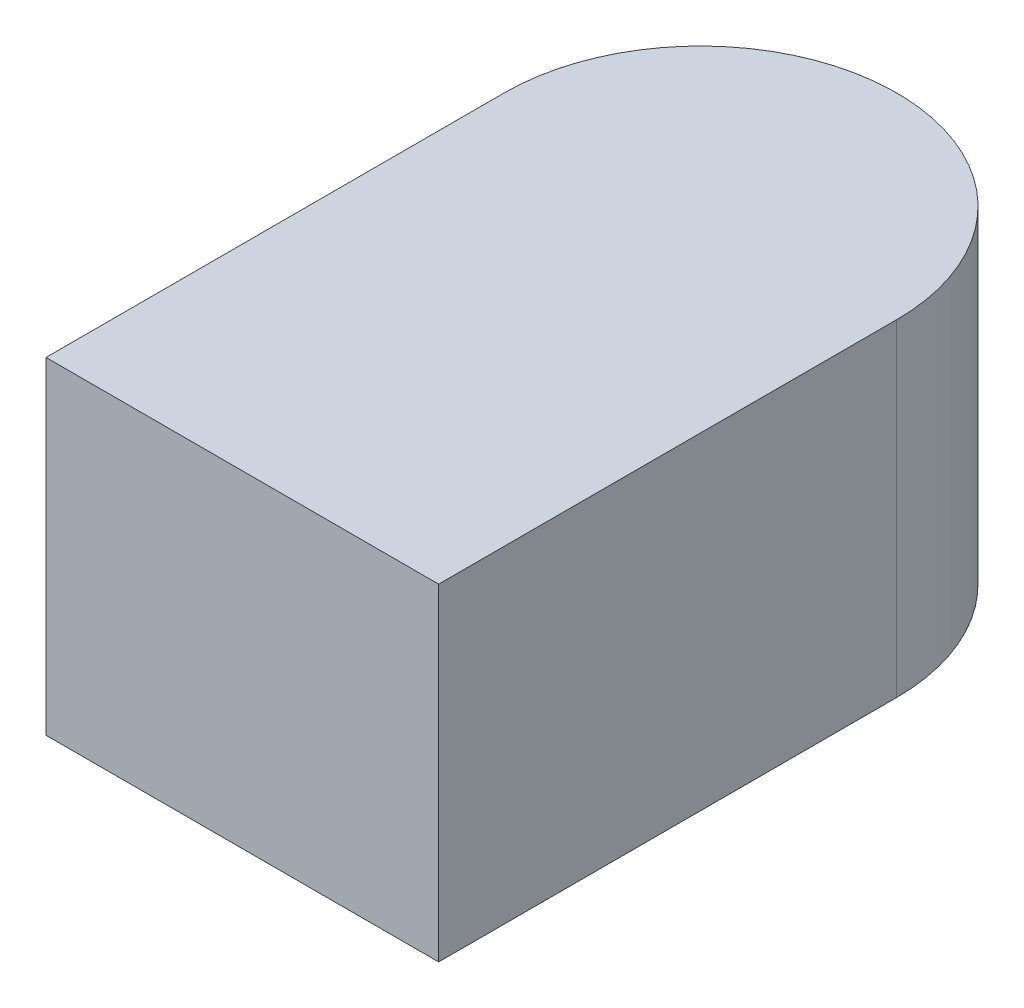
ISO-10303-21;
HEADER;
FILE_DESCRIPTION(('STEP AP214'),'2;1');
FILE_NAME('part.step','',(''),(''),'','','');
FILE_SCHEMA(('AUTOMOTIVE_DESIGN { 1 0 10303 214 1 1 1 1 }'));
ENDSEC;
DATA;
#1=APPLICATION_CONTEXT('core data for automotive mechanical design processes');
#2=APPLICATION_PROTOCOL_DEFINITION('international standard','automotive_design',2000,#1);
#3=PRODUCT_CONTEXT('',#1,'mechanical');
#4=PRODUCT('Part','Part','',(#3));
#5=PRODUCT_RELATED_PRODUCT_CATEGORY('part','',(#4));
#6=PRODUCT_DEFINITION_FORMATION('','',#4);
#7=PRODUCT_DEFINITION_CONTEXT('part definition',#1,'design');
#8=PRODUCT_DEFINITION('design','',#6,#7);
#9=PRODUCT_DEFINITION_SHAPE('','',#8);
#10=(LENGTH_UNIT() NAMED_UNIT(*) SI_UNIT(.MILLI.,.METRE.));
#11=(NAMED_UNIT(*) PLANE_ANGLE_UNIT() SI_UNIT($,.RADIAN.));
#12=(NAMED_UNIT(*) SI_UNIT($,.STERADIAN.) SOLID_ANGLE_UNIT());
#13=UNCERTAINTY_MEASURE_WITH_UNIT(LENGTH_MEASURE(1.E-05),#10,'distance_accuracy_value','');
#14=(GEOMETRIC_REPRESENTATION_CONTEXT(3) GLOBAL_UNCERTAINTY_ASSIGNED_CONTEXT((#13)) GLOBAL_UNIT_ASSIGNED_CONTEXT((#10,
#11,#12)) REPRESENTATION_CONTEXT('',''));
#15=CARTESIAN_POINT('',(0.,0.,0.));
#16=DIRECTION('',(0.,0.,1.));
#17=DIRECTION('',(1.,0.,0.));
#18=AXIS2_PLACEMENT_3D('',#15,#16,#17);
#19=CARTESIAN_POINT('',(0.,0.,0.));
#20=DIRECTION('',(0.,-1.,0.));
#21=DIRECTION('',(1.,0.,0.));
#22=AXIS2_PLACEMENT_3D('',#19,#20,#21);
#23=PLANE('',#22);
#24=CARTESIAN_POINT('',(0.75,0.,1.97));
#25=DIRECTION('',(0.,-1.,0.));
#26=DIRECTION('',(-1.,0.,0.));
#27=AXIS2_PLACEMENT_3D('',#24,#25,#26);
#28=CIRCLE('',#27,0.12);
#29=CARTESIAN_POINT('',(0.63,0.,1.97));
#30=VERTEX_POINT('',#29);
#31=CARTESIAN_POINT('',(0.87,0.,1.97));
#32=VERTEX_POINT('',#31);
#33=EDGE_CURVE('E11',#30,#32,#28,.T.);
#34=ORIENTED_EDGE('',*,*,#33,.T.);
#35=DIRECTION('',(0.,0.,1.));
#36=VECTOR('',#35,1.);
#37=CARTESIAN_POINT('',(0.87,0.,1.97));
#38=LINE('',#37,#36);
#39=CARTESIAN_POINT('',(0.87,0.,2.25));
#40=VERTEX_POINT('',#39);
#41=EDGE_CURVE('E24',#32,#40,#38,.T.);
#42=ORIENTED_EDGE('',*,*,#41,.T.);
#43=DIRECTION('',(-1.,0.,0.));
#44=VECTOR('',#43,1.);
#45=CARTESIAN_POINT('',(0.87,0.,2.25));
#46=LINE('',#45,#44);
#47=CARTESIAN_POINT('',(0.63,0.,2.25));
#48=VERTEX_POINT('',#47);
#49=EDGE_CURVE('E62',#40,#48,#46,.T.);
#50=ORIENTED_EDGE('',*,*,#49,.T.);
#51=DIRECTION('',(0.,0.,-1.));
#52=VECTOR('',#51,1.);
#53=CARTESIAN_POINT('',(0.63,0.,2.25));
#54=LINE('',#53,#52);
#55=EDGE_CURVE('E36',#48,#30,#54,.T.);
#56=ORIENTED_EDGE('',*,*,#55,.T.);
#57=EDGE_LOOP('',(#34,#42,#50,#56));
#58=FACE_BOUND('',#57,.T.);
#59=ADVANCED_FACE('F17',(#58),#23,.T.);
#60=CARTESIAN_POINT('',(0.63,0.,2.25));
#61=DIRECTION('',(1.,0.,0.));
#62=DIRECTION('',(0.,0.,-1.));
#63=AXIS2_PLACEMENT_3D('',#60,#61,#62);
#64=PLANE('',#63);
#65=DIRECTION('',(0.,1.,0.));
#66=VECTOR('',#65,1.);
#67=CARTESIAN_POINT('',(0.63,0.,2.25));
#68=LINE('',#67,#66);
#69=CARTESIAN_POINT('',(0.63,0.2,2.25));
#70=VERTEX_POINT('',#69);
#71=EDGE_CURVE('E84',#48,#70,#68,.T.);
#72=ORIENTED_EDGE('',*,*,#71,.T.);
#73=DIRECTION('',(0.,0.,-1.));
#74=VECTOR('',#73,1.);
#75=CARTESIAN_POINT('',(0.63,0.2,2.25));
#76=LINE('',#75,#74);
#77=CARTESIAN_POINT('',(0.63,0.2,1.97));
#78=VERTEX_POINT('',#77);
#79=EDGE_CURVE('E74',#70,#78,#76,.T.);
#80=ORIENTED_EDGE('',*,*,#79,.T.);
#81=DIRECTION('',(0.,1.,0.));
#82=VECTOR('',#81,1.);
#83=CARTESIAN_POINT('',(0.63,0.,1.97));
#84=LINE('',#83,#82);
#85=EDGE_CURVE('E81',#30,#78,#84,.T.);
#86=ORIENTED_EDGE('',*,*,#85,.F.);
#87=ORIENTED_EDGE('',*,*,#55,.F.);
#88=EDGE_LOOP('',(#72,#80,#86,#87));
#89=FACE_BOUND('',#88,.T.);
#90=ADVANCED_FACE('F91',(#89),#64,.F.);
#91=CARTESIAN_POINT('',(0.75,0.,1.97));
#92=DIRECTION('',(0.,-1.,0.));
#93=DIRECTION('',(1.,0.,0.));
#94=AXIS2_PLACEMENT_3D('',#91,#92,#93);
#95=CYLINDRICAL_SURFACE('',#94,0.12);
#96=ORIENTED_EDGE('',*,*,#85,.T.);
#97=CARTESIAN_POINT('',(0.75,0.2,1.97));
#98=DIRECTION('',(0.,-1.,0.));
#99=DIRECTION('',(-1.,0.,0.));
#100=AXIS2_PLACEMENT_3D('',#97,#98,#99);
#101=CIRCLE('',#100,0.12);
#102=CARTESIAN_POINT('',(0.87,0.2,1.97));
#103=VERTEX_POINT('',#102);
#104=EDGE_CURVE('E79',#78,#103,#101,.T.);
#105=ORIENTED_EDGE('',*,*,#104,.T.);
#106=DIRECTION('',(0.,1.,0.));
#107=VECTOR('',#106,1.);
#108=CARTESIAN_POINT('',(0.87,0.,1.97));
#109=LINE('',#108,#107);
#110=EDGE_CURVE('E68',#32,#103,#109,.T.);
#111=ORIENTED_EDGE('',*,*,#110,.F.);
#112=ORIENTED_EDGE('',*,*,#33,.F.);
#113=EDGE_LOOP('',(#96,#105,#111,#112));
#114=FACE_BOUND('',#113,.T.);
#115=ADVANCED_FACE('F89',(#114),#95,.T.);
#116=CARTESIAN_POINT('',(0.87,0.,1.97));
#117=DIRECTION('',(-1.,0.,0.));
#118=DIRECTION('',(0.,0.,1.));
#119=AXIS2_PLACEMENT_3D('',#116,#117,#118);
#120=PLANE('',#119);
#121=ORIENTED_EDGE('',*,*,#110,.T.);
#122=DIRECTION('',(0.,0.,1.));
#123=VECTOR('',#122,1.);
#124=CARTESIAN_POINT('',(0.87,0.2,1.97));
#125=LINE('',#124,#123);
#126=CARTESIAN_POINT('',(0.87,0.2,2.25));
#127=VERTEX_POINT('',#126);
#128=EDGE_CURVE('E63',#103,#127,#125,.T.);
#129=ORIENTED_EDGE('',*,*,#128,.T.);
#130=DIRECTION('',(0.,1.,0.));
#131=VECTOR('',#130,1.);
#132=CARTESIAN_POINT('',(0.87,0.,2.25));
#133=LINE('',#132,#131);
#134=EDGE_CURVE('E56',#40,#127,#133,.T.);
#135=ORIENTED_EDGE('',*,*,#134,.F.);
#136=ORIENTED_EDGE('',*,*,#41,.F.);
#137=EDGE_LOOP('',(#121,#129,#135,#136));
#138=FACE_BOUND('',#137,.T.);
#139=ADVANCED_FACE('F66',(#138),#120,.F.);
#140=CARTESIAN_POINT('',(0.87,0.,2.25));
#141=DIRECTION('',(0.,0.,-1.));
#142=DIRECTION('',(-1.,0.,0.));
#143=AXIS2_PLACEMENT_3D('',#140,#141,#142);
#144=PLANE('',#143);
#145=ORIENTED_EDGE('',*,*,#134,.T.);
#146=DIRECTION('',(-1.,0.,0.));
#147=VECTOR('',#146,1.);
#148=CARTESIAN_POINT('',(0.87,0.2,2.25));
#149=LINE('',#148,#147);
#150=EDGE_CURVE('E61',#127,#70,#149,.T.);
#151=ORIENTED_EDGE('',*,*,#150,.T.);
#152=ORIENTED_EDGE('',*,*,#71,.F.);
#153=ORIENTED_EDGE('',*,*,#49,.F.);
#154=EDGE_LOOP('',(#145,#151,#152,#153));
#155=FACE_BOUND('',#154,.T.);
#156=ADVANCED_FACE('F58',(#155),#144,.F.);
#157=CARTESIAN_POINT('',(0.,0.2,0.));
#158=DIRECTION('',(0.,-1.,0.));
#159=DIRECTION('',(1.,0.,0.));
#160=AXIS2_PLACEMENT_3D('',#157,#158,#159);
#161=PLANE('',#160);
#162=ORIENTED_EDGE('',*,*,#150,.F.);
#163=ORIENTED_EDGE('',*,*,#128,.F.);
#164=ORIENTED_EDGE('',*,*,#104,.F.);
#165=ORIENTED_EDGE('',*,*,#79,.F.);
#166=EDGE_LOOP('',(#162,#163,#164,#165));
#167=FACE_BOUND('',#166,.T.);
#168=ADVANCED_FACE('F72',(#167),#161,.F.);
#169=CLOSED_SHELL('',(#59,#90,#115,#139,#156,#168));
#170=MANIFOLD_SOLID_BREP('B1',#169);
#171=ADVANCED_BREP_SHAPE_REPRESENTATION('',(#18,#170),#14);
#172=SHAPE_DEFINITION_REPRESENTATION(#9,#171);
ENDSEC;
END-ISO-10303-21;
